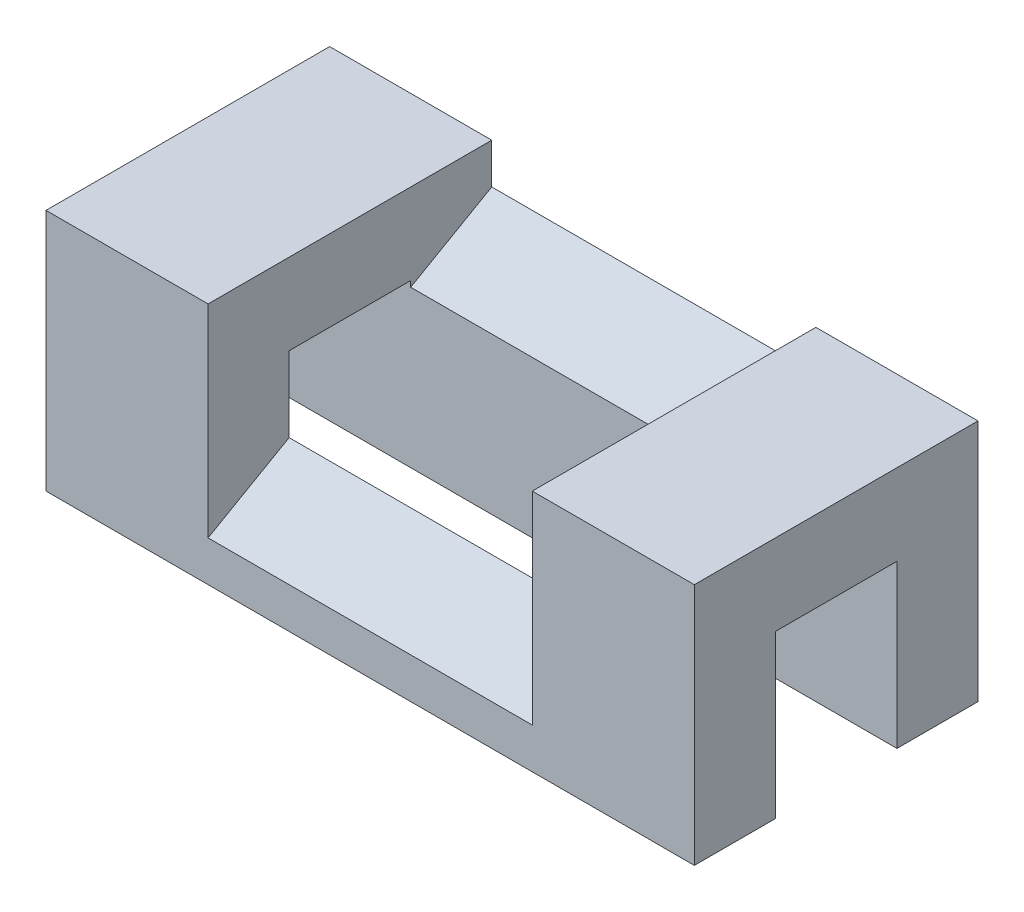
ISO-10303-21;
HEADER;
FILE_DESCRIPTION(('STEP AP214'),'2;1');
FILE_NAME('part.step','',(''),(''),'','','');
FILE_SCHEMA(('AUTOMOTIVE_DESIGN { 1 0 10303 214 1 1 1 1 }'));
ENDSEC;
DATA;
#1=APPLICATION_CONTEXT('core data for automotive mechanical design processes');
#2=APPLICATION_PROTOCOL_DEFINITION('international standard','automotive_design',2000,#1);
#3=PRODUCT_CONTEXT('',#1,'mechanical');
#4=PRODUCT('Part','Part','',(#3));
#5=PRODUCT_RELATED_PRODUCT_CATEGORY('part','',(#4));
#6=PRODUCT_DEFINITION_FORMATION('','',#4);
#7=PRODUCT_DEFINITION_CONTEXT('part definition',#1,'design');
#8=PRODUCT_DEFINITION('design','',#6,#7);
#9=PRODUCT_DEFINITION_SHAPE('','',#8);
#10=(LENGTH_UNIT() NAMED_UNIT(*) SI_UNIT(.MILLI.,.METRE.));
#11=(NAMED_UNIT(*) PLANE_ANGLE_UNIT() SI_UNIT($,.RADIAN.));
#12=(NAMED_UNIT(*) SI_UNIT($,.STERADIAN.) SOLID_ANGLE_UNIT());
#13=UNCERTAINTY_MEASURE_WITH_UNIT(LENGTH_MEASURE(1.E-05),#10,'distance_accuracy_value','');
#14=(GEOMETRIC_REPRESENTATION_CONTEXT(3) GLOBAL_UNCERTAINTY_ASSIGNED_CONTEXT((#13)) GLOBAL_UNIT_ASSIGNED_CONTEXT((#10,
#11,#12)) REPRESENTATION_CONTEXT('',''));
#15=CARTESIAN_POINT('',(0.,0.,0.));
#16=DIRECTION('',(0.,0.,1.));
#17=DIRECTION('',(1.,0.,0.));
#18=AXIS2_PLACEMENT_3D('',#15,#16,#17);
#19=CARTESIAN_POINT('',(40.,0.,-10.));
#20=DIRECTION('',(0.,0.,1.));
#21=DIRECTION('',(1.,0.,0.));
#22=AXIS2_PLACEMENT_3D('',#19,#20,#21);
#23=PLANE('',#22);
#24=DIRECTION('',(0.,1.,0.));
#25=VECTOR('',#24,1.);
#26=CARTESIAN_POINT('',(-20.,0.,-10.));
#27=LINE('',#26,#25);
#28=CARTESIAN_POINT('',(-20.,10.7142857142857,-10.));
#29=VERTEX_POINT('',#28);
#30=CARTESIAN_POINT('',(-20.,20.,-10.));
#31=VERTEX_POINT('',#30);
#32=EDGE_CURVE('E279',#29,#31,#27,.T.);
#33=ORIENTED_EDGE('',*,*,#32,.F.);
#34=DIRECTION('',(1.,0.,0.));
#35=VECTOR('',#34,1.);
#36=CARTESIAN_POINT('',(40.,10.7142857142857,-10.));
#37=LINE('',#36,#35);
#38=CARTESIAN_POINT('',(20.,10.7142857142857,-10.));
#39=VERTEX_POINT('',#38);
#40=EDGE_CURVE('E271',#29,#39,#37,.T.);
#41=ORIENTED_EDGE('',*,*,#40,.T.);
#42=DIRECTION('',(0.,1.,0.));
#43=VECTOR('',#42,1.);
#44=CARTESIAN_POINT('',(20.,0.,-10.));
#45=LINE('',#44,#43);
#46=CARTESIAN_POINT('',(20.,20.,-10.));
#47=VERTEX_POINT('',#46);
#48=EDGE_CURVE('E315',#39,#47,#45,.T.);
#49=ORIENTED_EDGE('',*,*,#48,.T.);
#50=DIRECTION('',(-1.,0.,0.));
#51=VECTOR('',#50,1.);
#52=CARTESIAN_POINT('',(40.,20.,-10.));
#53=LINE('',#52,#51);
#54=CARTESIAN_POINT('',(40.,20.,-10.));
#55=VERTEX_POINT('',#54);
#56=EDGE_CURVE('E50',#55,#47,#53,.T.);
#57=ORIENTED_EDGE('',*,*,#56,.F.);
#58=DIRECTION('',(0.,1.,0.));
#59=VECTOR('',#58,1.);
#60=CARTESIAN_POINT('',(40.,0.,-10.));
#61=LINE('',#60,#59);
#62=CARTESIAN_POINT('',(40.,0.,-10.));
#63=VERTEX_POINT('',#62);
#64=EDGE_CURVE('E285',#63,#55,#61,.T.);
#65=ORIENTED_EDGE('',*,*,#64,.F.);
#66=DIRECTION('',(-1.,0.,0.));
#67=VECTOR('',#66,1.);
#68=CARTESIAN_POINT('',(40.,0.,-10.));
#69=LINE('',#68,#67);
#70=CARTESIAN_POINT('',(-40.,0.,-10.));
#71=VERTEX_POINT('',#70);
#72=EDGE_CURVE('E11',#63,#71,#69,.T.);
#73=ORIENTED_EDGE('',*,*,#72,.T.);
#74=DIRECTION('',(0.,1.,0.));
#75=VECTOR('',#74,1.);
#76=CARTESIAN_POINT('',(-40.,0.,-10.));
#77=LINE('',#76,#75);
#78=CARTESIAN_POINT('',(-40.,20.,-10.));
#79=VERTEX_POINT('',#78);
#80=EDGE_CURVE('E224',#71,#79,#77,.T.);
#81=ORIENTED_EDGE('',*,*,#80,.T.);
#82=EDGE_CURVE('E203',#31,#79,#53,.T.);
#83=ORIENTED_EDGE('',*,*,#82,.F.);
#84=EDGE_LOOP('',(#33,#41,#49,#57,#65,#73,#81,#83));
#85=FACE_BOUND('',#84,.T.);
#86=ADVANCED_FACE('F41',(#85),#23,.F.);
#87=CARTESIAN_POINT('',(40.,20.,-10.));
#88=DIRECTION('',(0.,1.,0.));
#89=DIRECTION('',(0.,0.,1.));
#90=AXIS2_PLACEMENT_3D('',#87,#88,#89);
#91=PLANE('',#90);
#92=DIRECTION('',(0.,0.,-1.));
#93=VECTOR('',#92,1.);
#94=CARTESIAN_POINT('',(-20.,20.,-10.));
#95=LINE('',#94,#93);
#96=CARTESIAN_POINT('',(-20.,20.,-25.));
#97=VERTEX_POINT('',#96);
#98=EDGE_CURVE('E221',#31,#97,#95,.T.);
#99=ORIENTED_EDGE('',*,*,#98,.F.);
#100=ORIENTED_EDGE('',*,*,#82,.T.);
#101=DIRECTION('',(0.,0.,-1.));
#102=VECTOR('',#101,1.);
#103=CARTESIAN_POINT('',(-40.,20.,-10.));
#104=LINE('',#103,#102);
#105=CARTESIAN_POINT('',(-40.,20.,-25.));
#106=VERTEX_POINT('',#105);
#107=EDGE_CURVE('E219',#79,#106,#104,.T.);
#108=ORIENTED_EDGE('',*,*,#107,.T.);
#109=DIRECTION('',(-1.,0.,0.));
#110=VECTOR('',#109,1.);
#111=CARTESIAN_POINT('',(40.,20.,-25.));
#112=LINE('',#111,#110);
#113=EDGE_CURVE('E199',#97,#106,#112,.T.);
#114=ORIENTED_EDGE('',*,*,#113,.F.);
#115=EDGE_LOOP('',(#99,#100,#108,#114));
#116=FACE_BOUND('',#115,.T.);
#117=ADVANCED_FACE('F216',(#116),#91,.F.);
#118=CARTESIAN_POINT('',(40.,0.,-25.));
#119=DIRECTION('',(0.,0.,-1.));
#120=DIRECTION('',(-1.,0.,0.));
#121=AXIS2_PLACEMENT_3D('',#118,#119,#120);
#122=PLANE('',#121);
#123=DIRECTION('',(0.,-1.,0.));
#124=VECTOR('',#123,1.);
#125=CARTESIAN_POINT('',(-20.,0.,-25.));
#126=LINE('',#125,#124);
#127=CARTESIAN_POINT('',(-20.,19.2857142857143,-25.));
#128=VERTEX_POINT('',#127);
#129=EDGE_CURVE('E390',#97,#128,#126,.T.);
#130=ORIENTED_EDGE('',*,*,#129,.F.);
#131=ORIENTED_EDGE('',*,*,#113,.T.);
#132=DIRECTION('',(0.,-1.,0.));
#133=VECTOR('',#132,1.);
#134=CARTESIAN_POINT('',(-40.,0.,-25.));
#135=LINE('',#134,#133);
#136=CARTESIAN_POINT('',(-40.,0.,-25.));
#137=VERTEX_POINT('',#136);
#138=EDGE_CURVE('E234',#106,#137,#135,.T.);
#139=ORIENTED_EDGE('',*,*,#138,.T.);
#140=DIRECTION('',(-1.,0.,0.));
#141=VECTOR('',#140,1.);
#142=CARTESIAN_POINT('',(40.,0.,-25.));
#143=LINE('',#142,#141);
#144=CARTESIAN_POINT('',(40.,0.,-25.));
#145=VERTEX_POINT('',#144);
#146=EDGE_CURVE('E195',#145,#137,#143,.T.);
#147=ORIENTED_EDGE('',*,*,#146,.F.);
#148=DIRECTION('',(0.,-1.,0.));
#149=VECTOR('',#148,1.);
#150=CARTESIAN_POINT('',(40.,0.,-25.));
#151=LINE('',#150,#149);
#152=CARTESIAN_POINT('',(40.,20.,-25.));
#153=VERTEX_POINT('',#152);
#154=EDGE_CURVE('E291',#153,#145,#151,.T.);
#155=ORIENTED_EDGE('',*,*,#154,.F.);
#156=CARTESIAN_POINT('',(20.,20.,-25.));
#157=VERTEX_POINT('',#156);
#158=EDGE_CURVE('E200',#153,#157,#112,.T.);
#159=ORIENTED_EDGE('',*,*,#158,.T.);
#160=DIRECTION('',(0.,-1.,0.));
#161=VECTOR('',#160,1.);
#162=CARTESIAN_POINT('',(20.,0.,-25.));
#163=LINE('',#162,#161);
#164=CARTESIAN_POINT('',(20.,19.2857142857143,-25.));
#165=VERTEX_POINT('',#164);
#166=EDGE_CURVE('E376',#157,#165,#163,.T.);
#167=ORIENTED_EDGE('',*,*,#166,.T.);
#168=DIRECTION('',(-1.,0.,0.));
#169=VECTOR('',#168,1.);
#170=CARTESIAN_POINT('',(40.,19.2857142857143,-25.));
#171=LINE('',#170,#169);
#172=EDGE_CURVE('E274',#165,#128,#171,.T.);
#173=ORIENTED_EDGE('',*,*,#172,.T.);
#174=EDGE_LOOP('',(#130,#131,#139,#147,#155,#159,#167,#173));
#175=FACE_BOUND('',#174,.T.);
#176=ADVANCED_FACE('F323',(#175),#122,.F.);
#177=CARTESIAN_POINT('',(40.,30.,-35.));
#178=DIRECTION('',(0.,0.,1.));
#179=DIRECTION('',(1.,0.,0.));
#180=AXIS2_PLACEMENT_3D('',#177,#178,#179);
#181=PLANE('',#180);
#182=DIRECTION('',(0.,1.,0.));
#183=VECTOR('',#182,1.);
#184=CARTESIAN_POINT('',(-20.,30.,-35.));
#185=LINE('',#184,#183);
#186=CARTESIAN_POINT('',(-20.,25.,-35.));
#187=VERTEX_POINT('',#186);
#188=CARTESIAN_POINT('',(-20.,30.,-35.));
#189=VERTEX_POINT('',#188);
#190=EDGE_CURVE('E153',#187,#189,#185,.T.);
#191=ORIENTED_EDGE('',*,*,#190,.F.);
#192=DIRECTION('',(1.,0.,0.));
#193=VECTOR('',#192,1.);
#194=CARTESIAN_POINT('',(-20.,25.,-35.));
#195=LINE('',#194,#193);
#196=CARTESIAN_POINT('',(20.,25.,-35.));
#197=VERTEX_POINT('',#196);
#198=EDGE_CURVE('E369',#187,#197,#195,.T.);
#199=ORIENTED_EDGE('',*,*,#198,.T.);
#200=DIRECTION('',(0.,1.,0.));
#201=VECTOR('',#200,1.);
#202=CARTESIAN_POINT('',(20.,30.,-35.));
#203=LINE('',#202,#201);
#204=CARTESIAN_POINT('',(20.,30.,-35.));
#205=VERTEX_POINT('',#204);
#206=EDGE_CURVE('E305',#197,#205,#203,.T.);
#207=ORIENTED_EDGE('',*,*,#206,.T.);
#208=DIRECTION('',(-1.,0.,0.));
#209=VECTOR('',#208,1.);
#210=CARTESIAN_POINT('',(40.,30.,-35.));
#211=LINE('',#210,#209);
#212=CARTESIAN_POINT('',(40.,30.,-35.));
#213=VERTEX_POINT('',#212);
#214=EDGE_CURVE('E182',#213,#205,#211,.T.);
#215=ORIENTED_EDGE('',*,*,#214,.F.);
#216=DIRECTION('',(0.,1.,0.));
#217=VECTOR('',#216,1.);
#218=CARTESIAN_POINT('',(40.,30.,-35.));
#219=LINE('',#218,#217);
#220=CARTESIAN_POINT('',(40.,0.,-35.));
#221=VERTEX_POINT('',#220);
#222=EDGE_CURVE('E267',#221,#213,#219,.T.);
#223=ORIENTED_EDGE('',*,*,#222,.F.);
#224=DIRECTION('',(-1.,0.,0.));
#225=VECTOR('',#224,1.);
#226=CARTESIAN_POINT('',(40.,0.,-35.));
#227=LINE('',#226,#225);
#228=CARTESIAN_POINT('',(-40.,0.,-35.));
#229=VERTEX_POINT('',#228);
#230=EDGE_CURVE('E188',#221,#229,#227,.T.);
#231=ORIENTED_EDGE('',*,*,#230,.T.);
#232=DIRECTION('',(0.,1.,0.));
#233=VECTOR('',#232,1.);
#234=CARTESIAN_POINT('',(-40.,30.,-35.));
#235=LINE('',#234,#233);
#236=CARTESIAN_POINT('',(-40.,30.,-35.));
#237=VERTEX_POINT('',#236);
#238=EDGE_CURVE('E179',#229,#237,#235,.T.);
#239=ORIENTED_EDGE('',*,*,#238,.T.);
#240=EDGE_CURVE('E170',#189,#237,#211,.T.);
#241=ORIENTED_EDGE('',*,*,#240,.F.);
#242=EDGE_LOOP('',(#191,#199,#207,#215,#223,#231,#239,#241));
#243=FACE_BOUND('',#242,.T.);
#244=ADVANCED_FACE('F176',(#243),#181,.F.);
#245=CARTESIAN_POINT('',(40.,30.,0.));
#246=DIRECTION('',(0.,-1.,0.));
#247=DIRECTION('',(0.,0.,-1.));
#248=AXIS2_PLACEMENT_3D('',#245,#246,#247);
#249=PLANE('',#248);
#250=DIRECTION('',(0.,0.,1.));
#251=VECTOR('',#250,1.);
#252=CARTESIAN_POINT('',(-20.,30.,0.));
#253=LINE('',#252,#251);
#254=CARTESIAN_POINT('',(-20.,30.,0.));
#255=VERTEX_POINT('',#254);
#256=EDGE_CURVE('E156',#189,#255,#253,.T.);
#257=ORIENTED_EDGE('',*,*,#256,.F.);
#258=ORIENTED_EDGE('',*,*,#240,.T.);
#259=DIRECTION('',(0.,0.,1.));
#260=VECTOR('',#259,1.);
#261=CARTESIAN_POINT('',(-40.,30.,0.));
#262=LINE('',#261,#260);
#263=CARTESIAN_POINT('',(-40.,30.,0.));
#264=VERTEX_POINT('',#263);
#265=EDGE_CURVE('E246',#237,#264,#262,.T.);
#266=ORIENTED_EDGE('',*,*,#265,.T.);
#267=DIRECTION('',(-1.,0.,0.));
#268=VECTOR('',#267,1.);
#269=CARTESIAN_POINT('',(40.,30.,0.));
#270=LINE('',#269,#268);
#271=EDGE_CURVE('E172',#255,#264,#270,.T.);
#272=ORIENTED_EDGE('',*,*,#271,.F.);
#273=EDGE_LOOP('',(#257,#258,#266,#272));
#274=FACE_BOUND('',#273,.T.);
#275=ADVANCED_FACE('F168',(#274),#249,.F.);
#276=CARTESIAN_POINT('',(40.,0.,0.));
#277=DIRECTION('',(0.,0.,-1.));
#278=DIRECTION('',(-1.,0.,0.));
#279=AXIS2_PLACEMENT_3D('',#276,#277,#278);
#280=PLANE('',#279);
#281=DIRECTION('',(0.,-1.,0.));
#282=VECTOR('',#281,1.);
#283=CARTESIAN_POINT('',(-20.,5.,0.));
#284=LINE('',#283,#282);
#285=CARTESIAN_POINT('',(-20.,5.,0.));
#286=VERTEX_POINT('',#285);
#287=EDGE_CURVE('E174',#255,#286,#284,.T.);
#288=ORIENTED_EDGE('',*,*,#287,.F.);
#289=ORIENTED_EDGE('',*,*,#271,.T.);
#290=DIRECTION('',(0.,-1.,0.));
#291=VECTOR('',#290,1.);
#292=CARTESIAN_POINT('',(-40.,0.,0.));
#293=LINE('',#292,#291);
#294=CARTESIAN_POINT('',(-40.,0.,0.));
#295=VERTEX_POINT('',#294);
#296=EDGE_CURVE('E249',#264,#295,#293,.T.);
#297=ORIENTED_EDGE('',*,*,#296,.T.);
#298=DIRECTION('',(-1.,0.,0.));
#299=VECTOR('',#298,1.);
#300=CARTESIAN_POINT('',(40.,0.,0.));
#301=LINE('',#300,#299);
#302=CARTESIAN_POINT('',(40.,0.,0.));
#303=VERTEX_POINT('',#302);
#304=EDGE_CURVE('E252',#303,#295,#301,.T.);
#305=ORIENTED_EDGE('',*,*,#304,.F.);
#306=DIRECTION('',(0.,-1.,0.));
#307=VECTOR('',#306,1.);
#308=CARTESIAN_POINT('',(40.,0.,0.));
#309=LINE('',#308,#307);
#310=CARTESIAN_POINT('',(40.,30.,0.));
#311=VERTEX_POINT('',#310);
#312=EDGE_CURVE('E255',#311,#303,#309,.T.);
#313=ORIENTED_EDGE('',*,*,#312,.F.);
#314=CARTESIAN_POINT('',(20.,30.,0.));
#315=VERTEX_POINT('',#314);
#316=EDGE_CURVE('E183',#311,#315,#270,.T.);
#317=ORIENTED_EDGE('',*,*,#316,.T.);
#318=DIRECTION('',(0.,-1.,0.));
#319=VECTOR('',#318,1.);
#320=CARTESIAN_POINT('',(20.,5.,0.));
#321=LINE('',#320,#319);
#322=CARTESIAN_POINT('',(20.,5.,0.));
#323=VERTEX_POINT('',#322);
#324=EDGE_CURVE('E371',#315,#323,#321,.T.);
#325=ORIENTED_EDGE('',*,*,#324,.T.);
#326=DIRECTION('',(1.,0.,0.));
#327=VECTOR('',#326,1.);
#328=CARTESIAN_POINT('',(-20.,5.,0.));
#329=LINE('',#328,#327);
#330=EDGE_CURVE('E377',#286,#323,#329,.T.);
#331=ORIENTED_EDGE('',*,*,#330,.F.);
#332=EDGE_LOOP('',(#288,#289,#297,#305,#313,#317,#325,#331));
#333=FACE_BOUND('',#332,.T.);
#334=ADVANCED_FACE('F312',(#333),#280,.F.);
#335=CARTESIAN_POINT('',(40.,0.,0.));
#336=DIRECTION('',(0.,1.,0.));
#337=DIRECTION('',(0.,0.,1.));
#338=AXIS2_PLACEMENT_3D('',#335,#336,#337);
#339=PLANE('',#338);
#340=DIRECTION('',(0.,0.,-1.));
#341=VECTOR('',#340,1.);
#342=CARTESIAN_POINT('',(-40.,0.,0.));
#343=LINE('',#342,#341);
#344=EDGE_CURVE('E230',#295,#71,#343,.T.);
#345=ORIENTED_EDGE('',*,*,#344,.T.);
#346=ORIENTED_EDGE('',*,*,#72,.F.);
#347=DIRECTION('',(0.,0.,-1.));
#348=VECTOR('',#347,1.);
#349=CARTESIAN_POINT('',(40.,0.,0.));
#350=LINE('',#349,#348);
#351=EDGE_CURVE('E251',#303,#63,#350,.T.);
#352=ORIENTED_EDGE('',*,*,#351,.F.);
#353=ORIENTED_EDGE('',*,*,#304,.T.);
#354=EDGE_LOOP('',(#345,#346,#352,#353));
#355=FACE_BOUND('',#354,.T.);
#356=ADVANCED_FACE('F43',(#355),#339,.F.);
#357=ORIENTED_EDGE('',*,*,#56,.T.);
#358=DIRECTION('',(0.,0.,-1.));
#359=VECTOR('',#358,1.);
#360=CARTESIAN_POINT('',(20.,20.,-10.));
#361=LINE('',#360,#359);
#362=EDGE_CURVE('E318',#47,#157,#361,.T.);
#363=ORIENTED_EDGE('',*,*,#362,.T.);
#364=ORIENTED_EDGE('',*,*,#158,.F.);
#365=DIRECTION('',(0.,0.,-1.));
#366=VECTOR('',#365,1.);
#367=CARTESIAN_POINT('',(40.,20.,-10.));
#368=LINE('',#367,#366);
#369=EDGE_CURVE('E288',#55,#153,#368,.T.);
#370=ORIENTED_EDGE('',*,*,#369,.F.);
#371=EDGE_LOOP('',(#357,#363,#364,#370));
#372=FACE_BOUND('',#371,.T.);
#373=ADVANCED_FACE('F316',(#372),#91,.F.);
#374=CARTESIAN_POINT('',(40.,0.,-35.));
#375=DIRECTION('',(0.,1.,0.));
#376=DIRECTION('',(0.,0.,1.));
#377=AXIS2_PLACEMENT_3D('',#374,#375,#376);
#378=PLANE('',#377);
#379=DIRECTION('',(0.,0.,-1.));
#380=VECTOR('',#379,1.);
#381=CARTESIAN_POINT('',(-40.,0.,-35.));
#382=LINE('',#381,#380);
#383=EDGE_CURVE('E238',#137,#229,#382,.T.);
#384=ORIENTED_EDGE('',*,*,#383,.T.);
#385=ORIENTED_EDGE('',*,*,#230,.F.);
#386=DIRECTION('',(0.,0.,-1.));
#387=VECTOR('',#386,1.);
#388=CARTESIAN_POINT('',(40.,0.,-35.));
#389=LINE('',#388,#387);
#390=EDGE_CURVE('E294',#145,#221,#389,.T.);
#391=ORIENTED_EDGE('',*,*,#390,.F.);
#392=ORIENTED_EDGE('',*,*,#146,.T.);
#393=EDGE_LOOP('',(#384,#385,#391,#392));
#394=FACE_BOUND('',#393,.T.);
#395=ADVANCED_FACE('F325',(#394),#378,.F.);
#396=ORIENTED_EDGE('',*,*,#214,.T.);
#397=DIRECTION('',(0.,0.,1.));
#398=VECTOR('',#397,1.);
#399=CARTESIAN_POINT('',(20.,30.,0.));
#400=LINE('',#399,#398);
#401=EDGE_CURVE('E309',#205,#315,#400,.T.);
#402=ORIENTED_EDGE('',*,*,#401,.T.);
#403=ORIENTED_EDGE('',*,*,#316,.F.);
#404=DIRECTION('',(0.,0.,1.));
#405=VECTOR('',#404,1.);
#406=CARTESIAN_POINT('',(40.,30.,0.));
#407=LINE('',#406,#405);
#408=EDGE_CURVE('E261',#213,#311,#407,.T.);
#409=ORIENTED_EDGE('',*,*,#408,.F.);
#410=EDGE_LOOP('',(#396,#402,#403,#409));
#411=FACE_BOUND('',#410,.T.);
#412=ADVANCED_FACE('F308',(#411),#249,.F.);
#413=CARTESIAN_POINT('',(40.,0.,0.));
#414=DIRECTION('',(1.,0.,0.));
#415=DIRECTION('',(0.,0.,-1.));
#416=AXIS2_PLACEMENT_3D('',#413,#414,#415);
#417=PLANE('',#416);
#418=ORIENTED_EDGE('',*,*,#351,.T.);
#419=ORIENTED_EDGE('',*,*,#64,.T.);
#420=ORIENTED_EDGE('',*,*,#369,.T.);
#421=ORIENTED_EDGE('',*,*,#154,.T.);
#422=ORIENTED_EDGE('',*,*,#390,.T.);
#423=ORIENTED_EDGE('',*,*,#222,.T.);
#424=ORIENTED_EDGE('',*,*,#408,.T.);
#425=ORIENTED_EDGE('',*,*,#312,.T.);
#426=EDGE_LOOP('',(#418,#419,#420,#421,#422,#423,#424,#425));
#427=FACE_BOUND('',#426,.T.);
#428=ADVANCED_FACE('F299',(#427),#417,.T.);
#429=CARTESIAN_POINT('',(-40.,0.,0.));
#430=DIRECTION('',(1.,0.,0.));
#431=DIRECTION('',(0.,0.,-1.));
#432=AXIS2_PLACEMENT_3D('',#429,#430,#431);
#433=PLANE('',#432);
#434=ORIENTED_EDGE('',*,*,#344,.F.);
#435=ORIENTED_EDGE('',*,*,#296,.F.);
#436=ORIENTED_EDGE('',*,*,#265,.F.);
#437=ORIENTED_EDGE('',*,*,#238,.F.);
#438=ORIENTED_EDGE('',*,*,#383,.F.);
#439=ORIENTED_EDGE('',*,*,#138,.F.);
#440=ORIENTED_EDGE('',*,*,#107,.F.);
#441=ORIENTED_EDGE('',*,*,#80,.F.);
#442=EDGE_LOOP('',(#434,#435,#436,#437,#438,#439,#440,#441));
#443=FACE_BOUND('',#442,.T.);
#444=ADVANCED_FACE('F232',(#443),#433,.F.);
#445=CARTESIAN_POINT('',(-20.,25.,-35.));
#446=DIRECTION('',(0.,-0.868243142124459,-0.496138938356834));
#447=DIRECTION('',(0.,0.496138938356834,-0.868243142124459));
#448=AXIS2_PLACEMENT_3D('',#445,#446,#447);
#449=PLANE('',#448);
#450=DIRECTION('',(0.,0.496138938356834,-0.868243142124459));
#451=VECTOR('',#450,1.);
#452=CARTESIAN_POINT('',(-20.,25.,-35.));
#453=LINE('',#452,#451);
#454=EDGE_CURVE('E382',#286,#29,#453,.T.);
#455=ORIENTED_EDGE('',*,*,#454,.F.);
#456=ORIENTED_EDGE('',*,*,#330,.T.);
#457=DIRECTION('',(0.,0.496138938356834,-0.868243142124459));
#458=VECTOR('',#457,1.);
#459=CARTESIAN_POINT('',(20.,25.,-35.));
#460=LINE('',#459,#458);
#461=EDGE_CURVE('E64',#323,#39,#460,.T.);
#462=ORIENTED_EDGE('',*,*,#461,.T.);
#463=ORIENTED_EDGE('',*,*,#40,.F.);
#464=EDGE_LOOP('',(#455,#456,#462,#463));
#465=FACE_BOUND('',#464,.T.);
#466=ADVANCED_FACE('F352',(#465),#449,.F.);
#467=EDGE_CURVE('E57',#165,#197,#460,.T.);
#468=ORIENTED_EDGE('',*,*,#467,.T.);
#469=ORIENTED_EDGE('',*,*,#198,.F.);
#470=EDGE_CURVE('E159',#128,#187,#453,.T.);
#471=ORIENTED_EDGE('',*,*,#470,.F.);
#472=ORIENTED_EDGE('',*,*,#172,.F.);
#473=EDGE_LOOP('',(#468,#469,#471,#472));
#474=FACE_BOUND('',#473,.T.);
#475=ADVANCED_FACE('F357',(#474),#449,.F.);
#476=CARTESIAN_POINT('',(-20.,0.,0.));
#477=DIRECTION('',(1.,0.,0.));
#478=DIRECTION('',(0.,0.,-1.));
#479=AXIS2_PLACEMENT_3D('',#476,#477,#478);
#480=PLANE('',#479);
#481=ORIENTED_EDGE('',*,*,#32,.T.);
#482=ORIENTED_EDGE('',*,*,#98,.T.);
#483=ORIENTED_EDGE('',*,*,#129,.T.);
#484=ORIENTED_EDGE('',*,*,#470,.T.);
#485=ORIENTED_EDGE('',*,*,#190,.T.);
#486=ORIENTED_EDGE('',*,*,#256,.T.);
#487=ORIENTED_EDGE('',*,*,#287,.T.);
#488=ORIENTED_EDGE('',*,*,#454,.T.);
#489=EDGE_LOOP('',(#481,#482,#483,#484,#485,#486,#487,#488));
#490=FACE_BOUND('',#489,.T.);
#491=ADVANCED_FACE('F155',(#490),#480,.T.);
#492=CARTESIAN_POINT('',(20.,0.,0.));
#493=DIRECTION('',(1.,0.,0.));
#494=DIRECTION('',(0.,0.,-1.));
#495=AXIS2_PLACEMENT_3D('',#492,#493,#494);
#496=PLANE('',#495);
#497=ORIENTED_EDGE('',*,*,#461,.F.);
#498=ORIENTED_EDGE('',*,*,#324,.F.);
#499=ORIENTED_EDGE('',*,*,#401,.F.);
#500=ORIENTED_EDGE('',*,*,#206,.F.);
#501=ORIENTED_EDGE('',*,*,#467,.F.);
#502=ORIENTED_EDGE('',*,*,#166,.F.);
#503=ORIENTED_EDGE('',*,*,#362,.F.);
#504=ORIENTED_EDGE('',*,*,#48,.F.);
#505=EDGE_LOOP('',(#497,#498,#499,#500,#501,#502,#503,#504));
#506=FACE_BOUND('',#505,.T.);
#507=ADVANCED_FACE('F359',(#506),#496,.F.);
#508=CLOSED_SHELL('',(#86,#117,#176,#244,#275,#334,#356,#373,#395,#412,#428,#444,#466,#475,#491,#507));
#509=MANIFOLD_SOLID_BREP('B2',#508);
#510=ADVANCED_BREP_SHAPE_REPRESENTATION('',(#18,#509),#14);
#511=SHAPE_DEFINITION_REPRESENTATION(#9,#510);
ENDSEC;
END-ISO-10303-21;
